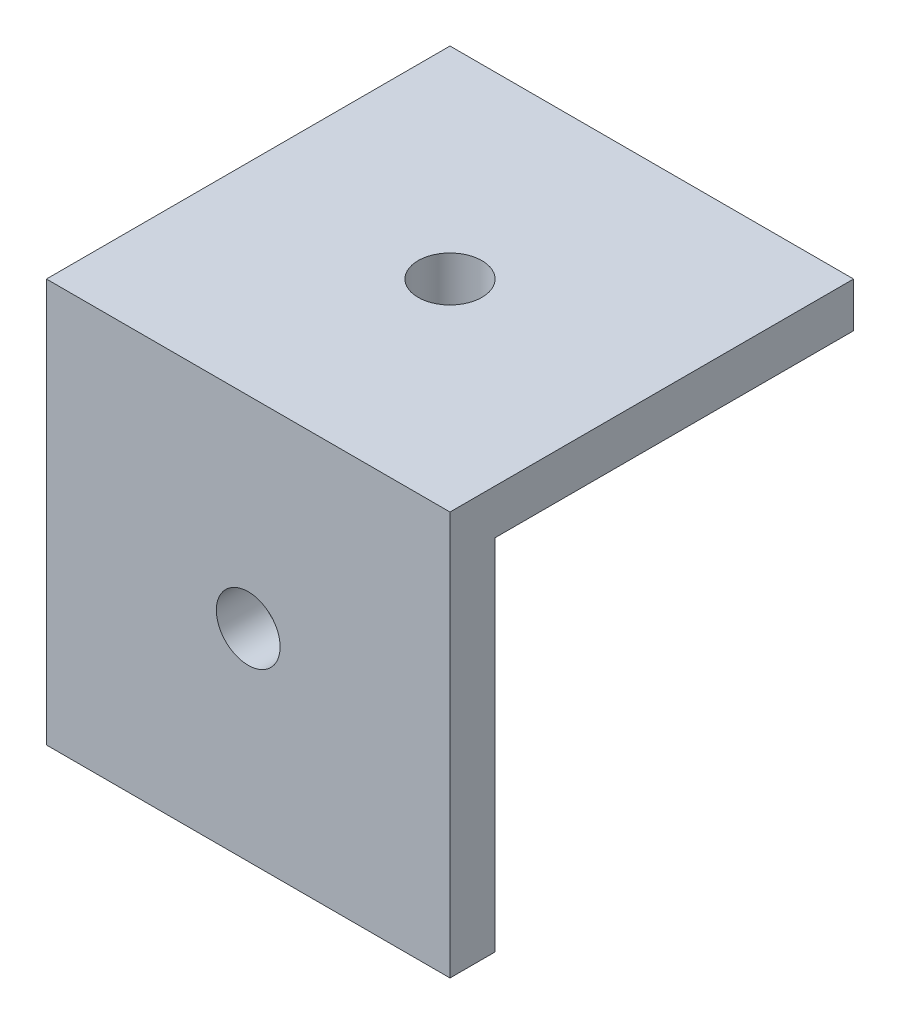
ISO-10303-21;
HEADER;
FILE_DESCRIPTION(('STEP AP214'),'2;1');
FILE_NAME('part.step','',(''),(''),'','','');
FILE_SCHEMA(('AUTOMOTIVE_DESIGN { 1 0 10303 214 1 1 1 1 }'));
ENDSEC;
DATA;
#1=APPLICATION_CONTEXT('core data for automotive mechanical design processes');
#2=APPLICATION_PROTOCOL_DEFINITION('international standard','automotive_design',2000,#1);
#3=PRODUCT_CONTEXT('',#1,'mechanical');
#4=PRODUCT('Part','Part','',(#3));
#5=PRODUCT_RELATED_PRODUCT_CATEGORY('part','',(#4));
#6=PRODUCT_DEFINITION_FORMATION('','',#4);
#7=PRODUCT_DEFINITION_CONTEXT('part definition',#1,'design');
#8=PRODUCT_DEFINITION('design','',#6,#7);
#9=PRODUCT_DEFINITION_SHAPE('','',#8);
#10=(LENGTH_UNIT() NAMED_UNIT(*) SI_UNIT(.MILLI.,.METRE.));
#11=(NAMED_UNIT(*) PLANE_ANGLE_UNIT() SI_UNIT($,.RADIAN.));
#12=(NAMED_UNIT(*) SI_UNIT($,.STERADIAN.) SOLID_ANGLE_UNIT());
#13=UNCERTAINTY_MEASURE_WITH_UNIT(LENGTH_MEASURE(1.E-05),#10,'distance_accuracy_value','');
#14=(GEOMETRIC_REPRESENTATION_CONTEXT(3) GLOBAL_UNCERTAINTY_ASSIGNED_CONTEXT((#13)) GLOBAL_UNIT_ASSIGNED_CONTEXT((#10,
#11,#12)) REPRESENTATION_CONTEXT('',''));
#15=CARTESIAN_POINT('',(0.,0.,0.));
#16=DIRECTION('',(0.,0.,1.));
#17=DIRECTION('',(1.,0.,0.));
#18=AXIS2_PLACEMENT_3D('',#15,#16,#17);
#19=CARTESIAN_POINT('',(9.,18.,9.));
#20=DIRECTION('',(-1.,0.,0.));
#21=DIRECTION('',(0.,0.,1.));
#22=AXIS2_PLACEMENT_3D('',#19,#20,#21);
#23=PLANE('',#22);
#24=DIRECTION('',(0.,1.,0.));
#25=VECTOR('',#24,1.);
#26=CARTESIAN_POINT('',(9.,18.,7.));
#27=LINE('',#26,#25);
#28=CARTESIAN_POINT('',(9.,0.,7.));
#29=VERTEX_POINT('',#28);
#30=CARTESIAN_POINT('',(9.,16.,7.));
#31=VERTEX_POINT('',#30);
#32=EDGE_CURVE('E181',#29,#31,#27,.T.);
#33=ORIENTED_EDGE('',*,*,#32,.T.);
#34=DIRECTION('',(0.,0.,-1.));
#35=VECTOR('',#34,1.);
#36=CARTESIAN_POINT('',(9.,16.,9.));
#37=LINE('',#36,#35);
#38=CARTESIAN_POINT('',(8.99999999999999,16.,-9.));
#39=VERTEX_POINT('',#38);
#40=EDGE_CURVE('E183',#31,#39,#37,.T.);
#41=ORIENTED_EDGE('',*,*,#40,.T.);
#42=DIRECTION('',(0.,-1.,0.));
#43=VECTOR('',#42,1.);
#44=CARTESIAN_POINT('',(9.,18.,-9.));
#45=LINE('',#44,#43);
#46=CARTESIAN_POINT('',(9.,18.,-9.));
#47=VERTEX_POINT('',#46);
#48=EDGE_CURVE('E11',#47,#39,#45,.T.);
#49=ORIENTED_EDGE('',*,*,#48,.F.);
#50=DIRECTION('',(0.,0.,-1.));
#51=VECTOR('',#50,1.);
#52=CARTESIAN_POINT('',(9.,18.,9.));
#53=LINE('',#52,#51);
#54=CARTESIAN_POINT('',(9.,18.,9.));
#55=VERTEX_POINT('',#54);
#56=EDGE_CURVE('E97',#55,#47,#53,.T.);
#57=ORIENTED_EDGE('',*,*,#56,.F.);
#58=DIRECTION('',(0.,-1.,0.));
#59=VECTOR('',#58,1.);
#60=CARTESIAN_POINT('',(9.,18.,9.));
#61=LINE('',#60,#59);
#62=CARTESIAN_POINT('',(9.,0.,9.));
#63=VERTEX_POINT('',#62);
#64=EDGE_CURVE('E115',#55,#63,#61,.T.);
#65=ORIENTED_EDGE('',*,*,#64,.T.);
#66=DIRECTION('',(0.,0.,-1.));
#67=VECTOR('',#66,1.);
#68=CARTESIAN_POINT('',(9.,0.,9.));
#69=LINE('',#68,#67);
#70=EDGE_CURVE('E119',#63,#29,#69,.T.);
#71=ORIENTED_EDGE('',*,*,#70,.T.);
#72=EDGE_LOOP('',(#33,#41,#49,#57,#65,#71));
#73=FACE_BOUND('',#72,.T.);
#74=ADVANCED_FACE('F38',(#73),#23,.F.);
#75=CARTESIAN_POINT('',(-9.,18.,-9.));
#76=DIRECTION('',(0.,0.,1.));
#77=DIRECTION('',(1.,0.,0.));
#78=AXIS2_PLACEMENT_3D('',#75,#76,#77);
#79=PLANE('',#78);
#80=ORIENTED_EDGE('',*,*,#48,.T.);
#81=DIRECTION('',(1.,0.,0.));
#82=VECTOR('',#81,1.);
#83=CARTESIAN_POINT('',(-9.,16.,-9.));
#84=LINE('',#83,#82);
#85=CARTESIAN_POINT('',(-9.,16.,-9.));
#86=VERTEX_POINT('',#85);
#87=EDGE_CURVE('E106',#86,#39,#84,.T.);
#88=ORIENTED_EDGE('',*,*,#87,.F.);
#89=DIRECTION('',(0.,-1.,0.));
#90=VECTOR('',#89,1.);
#91=CARTESIAN_POINT('',(-9.,18.,-9.));
#92=LINE('',#91,#90);
#93=CARTESIAN_POINT('',(-9.,18.,-9.));
#94=VERTEX_POINT('',#93);
#95=EDGE_CURVE('E48',#94,#86,#92,.T.);
#96=ORIENTED_EDGE('',*,*,#95,.F.);
#97=DIRECTION('',(-1.,0.,0.));
#98=VECTOR('',#97,1.);
#99=CARTESIAN_POINT('',(-9.,18.,-9.));
#100=LINE('',#99,#98);
#101=EDGE_CURVE('E91',#47,#94,#100,.T.);
#102=ORIENTED_EDGE('',*,*,#101,.F.);
#103=EDGE_LOOP('',(#80,#88,#96,#102));
#104=FACE_BOUND('',#103,.T.);
#105=ADVANCED_FACE('F104',(#104),#79,.F.);
#106=CARTESIAN_POINT('',(-9.,18.,9.));
#107=DIRECTION('',(1.,0.,0.));
#108=DIRECTION('',(0.,0.,-1.));
#109=AXIS2_PLACEMENT_3D('',#106,#107,#108);
#110=PLANE('',#109);
#111=ORIENTED_EDGE('',*,*,#95,.T.);
#112=DIRECTION('',(0.,0.,-1.));
#113=VECTOR('',#112,1.);
#114=CARTESIAN_POINT('',(-9.,16.,7.));
#115=LINE('',#114,#113);
#116=CARTESIAN_POINT('',(-9.,16.,7.));
#117=VERTEX_POINT('',#116);
#118=EDGE_CURVE('E136',#117,#86,#115,.T.);
#119=ORIENTED_EDGE('',*,*,#118,.F.);
#120=DIRECTION('',(0.,1.,0.));
#121=VECTOR('',#120,1.);
#122=CARTESIAN_POINT('',(-9.,16.,7.));
#123=LINE('',#122,#121);
#124=CARTESIAN_POINT('',(-9.,0.,7.));
#125=VERTEX_POINT('',#124);
#126=EDGE_CURVE('E193',#125,#117,#123,.T.);
#127=ORIENTED_EDGE('',*,*,#126,.F.);
#128=DIRECTION('',(0.,0.,1.));
#129=VECTOR('',#128,1.);
#130=CARTESIAN_POINT('',(-9.,0.,9.));
#131=LINE('',#130,#129);
#132=CARTESIAN_POINT('',(-9.,0.,9.));
#133=VERTEX_POINT('',#132);
#134=EDGE_CURVE('E69',#125,#133,#131,.T.);
#135=ORIENTED_EDGE('',*,*,#134,.T.);
#136=DIRECTION('',(0.,-1.,0.));
#137=VECTOR('',#136,1.);
#138=CARTESIAN_POINT('',(-9.,18.,9.));
#139=LINE('',#138,#137);
#140=CARTESIAN_POINT('',(-9.,18.,9.));
#141=VERTEX_POINT('',#140);
#142=EDGE_CURVE('E109',#141,#133,#139,.T.);
#143=ORIENTED_EDGE('',*,*,#142,.F.);
#144=DIRECTION('',(0.,0.,1.));
#145=VECTOR('',#144,1.);
#146=CARTESIAN_POINT('',(-9.,18.,9.));
#147=LINE('',#146,#145);
#148=EDGE_CURVE('E95',#94,#141,#147,.T.);
#149=ORIENTED_EDGE('',*,*,#148,.F.);
#150=EDGE_LOOP('',(#111,#119,#127,#135,#143,#149));
#151=FACE_BOUND('',#150,.T.);
#152=ADVANCED_FACE('F111',(#151),#110,.F.);
#153=CARTESIAN_POINT('',(-9.,18.,9.));
#154=DIRECTION('',(0.,0.,-1.));
#155=DIRECTION('',(-1.,0.,0.));
#156=AXIS2_PLACEMENT_3D('',#153,#154,#155);
#157=PLANE('',#156);
#158=CARTESIAN_POINT('',(0.,9.,9.));
#159=DIRECTION('',(0.,0.,1.));
#160=DIRECTION('',(1.,0.,0.));
#161=AXIS2_PLACEMENT_3D('',#158,#159,#160);
#162=CIRCLE('',#161,1.4224);
#163=CARTESIAN_POINT('',(1.4224,9.,9.));
#164=VERTEX_POINT('',#163);
#165=EDGE_CURVE('E142',#164,#164,#162,.T.);
#166=ORIENTED_EDGE('',*,*,#165,.F.);
#167=EDGE_LOOP('',(#166));
#168=FACE_BOUND('',#167,.T.);
#169=DIRECTION('',(1.,0.,0.));
#170=VECTOR('',#169,1.);
#171=CARTESIAN_POINT('',(-9.,0.,9.));
#172=LINE('',#171,#170);
#173=EDGE_CURVE('E126',#133,#63,#172,.T.);
#174=ORIENTED_EDGE('',*,*,#173,.T.);
#175=ORIENTED_EDGE('',*,*,#64,.F.);
#176=DIRECTION('',(1.,0.,0.));
#177=VECTOR('',#176,1.);
#178=CARTESIAN_POINT('',(-9.,18.,9.));
#179=LINE('',#178,#177);
#180=EDGE_CURVE('E57',#141,#55,#179,.T.);
#181=ORIENTED_EDGE('',*,*,#180,.F.);
#182=ORIENTED_EDGE('',*,*,#142,.T.);
#183=EDGE_LOOP('',(#174,#175,#181,#182));
#184=FACE_BOUND('',#183,.T.);
#185=ADVANCED_FACE('F162',(#168,#184),#157,.F.);
#186=CARTESIAN_POINT('',(0.,18.,0.));
#187=DIRECTION('',(0.,-1.,0.));
#188=DIRECTION('',(0.,0.,-1.));
#189=AXIS2_PLACEMENT_3D('',#186,#187,#188);
#190=PLANE('',#189);
#191=CARTESIAN_POINT('',(0.,18.,0.));
#192=DIRECTION('',(0.,1.,0.));
#193=DIRECTION('',(0.,0.,1.));
#194=AXIS2_PLACEMENT_3D('',#191,#192,#193);
#195=CIRCLE('',#194,1.4224);
#196=CARTESIAN_POINT('',(0.,18.,1.4224));
#197=VERTEX_POINT('',#196);
#198=EDGE_CURVE('E123',#197,#197,#195,.T.);
#199=ORIENTED_EDGE('',*,*,#198,.F.);
#200=EDGE_LOOP('',(#199));
#201=FACE_BOUND('',#200,.T.);
#202=ORIENTED_EDGE('',*,*,#56,.T.);
#203=ORIENTED_EDGE('',*,*,#101,.T.);
#204=ORIENTED_EDGE('',*,*,#148,.T.);
#205=ORIENTED_EDGE('',*,*,#180,.T.);
#206=EDGE_LOOP('',(#202,#203,#204,#205));
#207=FACE_BOUND('',#206,.T.);
#208=ADVANCED_FACE('F93',(#201,#207),#190,.F.);
#209=CARTESIAN_POINT('',(0.,0.,0.));
#210=DIRECTION('',(0.,-1.,0.));
#211=DIRECTION('',(0.,0.,-1.));
#212=AXIS2_PLACEMENT_3D('',#209,#210,#211);
#213=PLANE('',#212);
#214=DIRECTION('',(-1.,0.,0.));
#215=VECTOR('',#214,1.);
#216=CARTESIAN_POINT('',(-9.,0.,7.));
#217=LINE('',#216,#215);
#218=EDGE_CURVE('E80',#29,#125,#217,.T.);
#219=ORIENTED_EDGE('',*,*,#218,.F.);
#220=ORIENTED_EDGE('',*,*,#70,.F.);
#221=ORIENTED_EDGE('',*,*,#173,.F.);
#222=ORIENTED_EDGE('',*,*,#134,.F.);
#223=EDGE_LOOP('',(#219,#220,#221,#222));
#224=FACE_BOUND('',#223,.T.);
#225=ADVANCED_FACE('F161',(#224),#213,.T.);
#226=CARTESIAN_POINT('',(0.,11.4,0.));
#227=DIRECTION('',(0.,1.,0.));
#228=DIRECTION('',(0.,0.,1.));
#229=AXIS2_PLACEMENT_3D('',#226,#227,#228);
#230=CYLINDRICAL_SURFACE('',#229,1.4224);
#231=CARTESIAN_POINT('',(0.,16.,0.));
#232=DIRECTION('',(0.,1.,0.));
#233=DIRECTION('',(0.,0.,1.));
#234=AXIS2_PLACEMENT_3D('',#231,#232,#233);
#235=CIRCLE('',#234,1.4224);
#236=CARTESIAN_POINT('',(0.,16.,1.4224));
#237=VERTEX_POINT('',#236);
#238=EDGE_CURVE('E41',#237,#237,#235,.F.);
#239=ORIENTED_EDGE('',*,*,#238,.T.);
#240=EDGE_LOOP('',(#239));
#241=FACE_BOUND('',#240,.T.);
#242=ORIENTED_EDGE('',*,*,#198,.T.);
#243=EDGE_LOOP('',(#242));
#244=FACE_BOUND('',#243,.T.);
#245=ADVANCED_FACE('F158',(#241,#244),#230,.F.);
#246=CARTESIAN_POINT('',(0.,9.,2.4));
#247=DIRECTION('',(0.,0.,1.));
#248=DIRECTION('',(1.,0.,0.));
#249=AXIS2_PLACEMENT_3D('',#246,#247,#248);
#250=CYLINDRICAL_SURFACE('',#249,1.4224);
#251=CARTESIAN_POINT('',(0.,9.,7.));
#252=DIRECTION('',(0.,0.,1.));
#253=DIRECTION('',(1.,0.,0.));
#254=AXIS2_PLACEMENT_3D('',#251,#252,#253);
#255=CIRCLE('',#254,1.4224);
#256=CARTESIAN_POINT('',(1.4224,9.,7.));
#257=VERTEX_POINT('',#256);
#258=EDGE_CURVE('E133',#257,#257,#255,.F.);
#259=ORIENTED_EDGE('',*,*,#258,.T.);
#260=EDGE_LOOP('',(#259));
#261=FACE_BOUND('',#260,.T.);
#262=ORIENTED_EDGE('',*,*,#165,.T.);
#263=EDGE_LOOP('',(#262));
#264=FACE_BOUND('',#263,.T.);
#265=ADVANCED_FACE('F206',(#261,#264),#250,.F.);
#266=CARTESIAN_POINT('',(-9.,16.,7.));
#267=DIRECTION('',(0.,1.,0.));
#268=DIRECTION('',(0.,0.,1.));
#269=AXIS2_PLACEMENT_3D('',#266,#267,#268);
#270=PLANE('',#269);
#271=ORIENTED_EDGE('',*,*,#87,.T.);
#272=ORIENTED_EDGE('',*,*,#40,.F.);
#273=DIRECTION('',(1.,0.,0.));
#274=VECTOR('',#273,1.);
#275=CARTESIAN_POINT('',(-9.,16.,7.));
#276=LINE('',#275,#274);
#277=EDGE_CURVE('E146',#117,#31,#276,.T.);
#278=ORIENTED_EDGE('',*,*,#277,.F.);
#279=ORIENTED_EDGE('',*,*,#118,.T.);
#280=EDGE_LOOP('',(#271,#272,#278,#279));
#281=FACE_BOUND('',#280,.T.);
#282=ORIENTED_EDGE('',*,*,#238,.F.);
#283=EDGE_LOOP('',(#282));
#284=FACE_BOUND('',#283,.T.);
#285=ADVANCED_FACE('F199',(#281,#284),#270,.F.);
#286=CARTESIAN_POINT('',(0.,0.,7.));
#287=DIRECTION('',(0.,0.,1.));
#288=DIRECTION('',(1.,0.,0.));
#289=AXIS2_PLACEMENT_3D('',#286,#287,#288);
#290=PLANE('',#289);
#291=ORIENTED_EDGE('',*,*,#126,.T.);
#292=ORIENTED_EDGE('',*,*,#277,.T.);
#293=ORIENTED_EDGE('',*,*,#32,.F.);
#294=ORIENTED_EDGE('',*,*,#218,.T.);
#295=EDGE_LOOP('',(#291,#292,#293,#294));
#296=FACE_BOUND('',#295,.T.);
#297=ORIENTED_EDGE('',*,*,#258,.F.);
#298=EDGE_LOOP('',(#297));
#299=FACE_BOUND('',#298,.T.);
#300=ADVANCED_FACE('F197',(#296,#299),#290,.F.);
#301=CLOSED_SHELL('',(#74,#105,#152,#185,#208,#225,#245,#265,#285,#300));
#302=MANIFOLD_SOLID_BREP('B2',#301);
#303=ADVANCED_BREP_SHAPE_REPRESENTATION('',(#18,#302),#14);
#304=SHAPE_DEFINITION_REPRESENTATION(#9,#303);
ENDSEC;
END-ISO-10303-21;
